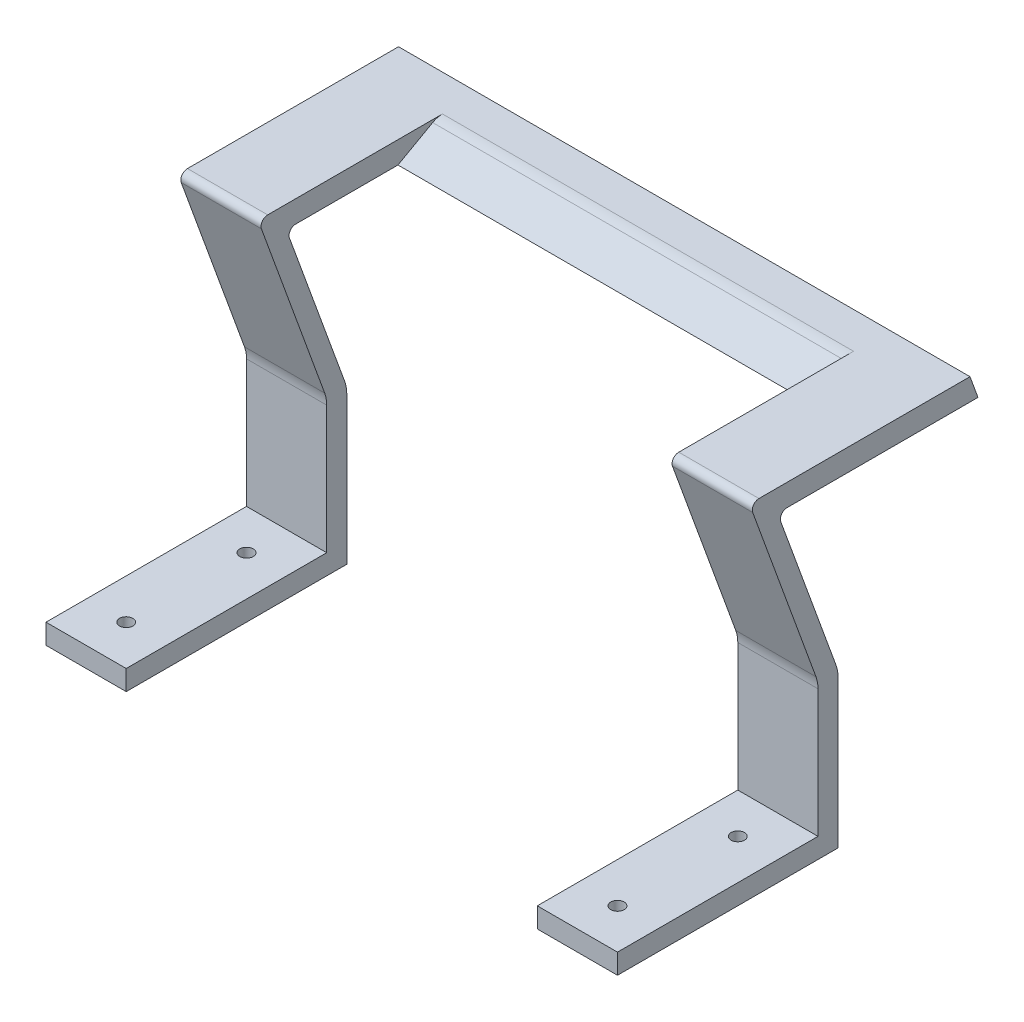
ISO-10303-21;
HEADER;
FILE_DESCRIPTION(('STEP AP214'),'2;1');
FILE_NAME('part.step','',(''),(''),'','','');
FILE_SCHEMA(('AUTOMOTIVE_DESIGN { 1 0 10303 214 1 1 1 1 }'));
ENDSEC;
DATA;
#1=APPLICATION_CONTEXT('core data for automotive mechanical design processes');
#2=APPLICATION_PROTOCOL_DEFINITION('international standard','automotive_design',2000,#1);
#3=PRODUCT_CONTEXT('',#1,'mechanical');
#4=PRODUCT('Part','Part','',(#3));
#5=PRODUCT_RELATED_PRODUCT_CATEGORY('part','',(#4));
#6=PRODUCT_DEFINITION_FORMATION('','',#4);
#7=PRODUCT_DEFINITION_CONTEXT('part definition',#1,'design');
#8=PRODUCT_DEFINITION('design','',#6,#7);
#9=PRODUCT_DEFINITION_SHAPE('','',#8);
#10=(LENGTH_UNIT() NAMED_UNIT(*) SI_UNIT(.MILLI.,.METRE.));
#11=(NAMED_UNIT(*) PLANE_ANGLE_UNIT() SI_UNIT($,.RADIAN.));
#12=(NAMED_UNIT(*) SI_UNIT($,.STERADIAN.) SOLID_ANGLE_UNIT());
#13=UNCERTAINTY_MEASURE_WITH_UNIT(LENGTH_MEASURE(1.E-05),#10,'distance_accuracy_value','');
#14=(GEOMETRIC_REPRESENTATION_CONTEXT(3) GLOBAL_UNCERTAINTY_ASSIGNED_CONTEXT((#13)) GLOBAL_UNIT_ASSIGNED_CONTEXT((#10,
#11,#12)) REPRESENTATION_CONTEXT('',''));
#15=CARTESIAN_POINT('',(0.,0.,0.));
#16=DIRECTION('',(0.,0.,1.));
#17=DIRECTION('',(1.,0.,0.));
#18=AXIS2_PLACEMENT_3D('',#15,#16,#17);
#19=CARTESIAN_POINT('',(12.,3.,-33.));
#20=DIRECTION('',(-1.,0.,0.));
#21=DIRECTION('',(0.,0.,1.));
#22=AXIS2_PLACEMENT_3D('',#19,#20,#21);
#23=PLANE('',#22);
#24=DIRECTION('',(0.,-1.,0.));
#25=VECTOR('',#24,1.);
#26=CARTESIAN_POINT('',(12.,3.,-33.));
#27=LINE('',#26,#25);
#28=CARTESIAN_POINT('',(12.,22.1183650964577,-33.));
#29=VERTEX_POINT('',#28);
#30=CARTESIAN_POINT('',(12.,0.,-33.));
#31=VERTEX_POINT('',#30);
#32=EDGE_CURVE('E451',#29,#31,#27,.T.);
#33=ORIENTED_EDGE('',*,*,#32,.F.);
#34=CARTESIAN_POINT('',(12.,22.1183650964577,-28.));
#35=DIRECTION('',(-1.,0.,0.));
#36=DIRECTION('',(0.,0.,1.));
#37=AXIS2_PLACEMENT_3D('',#34,#35,#36);
#38=CIRCLE('',#37,5.);
#39=CARTESIAN_POINT('',(12.,23.828465813086,-32.6984631039295));
#40=VERTEX_POINT('',#39);
#41=EDGE_CURVE('E507',#29,#40,#38,.F.);
#42=ORIENTED_EDGE('',*,*,#41,.T.);
#43=DIRECTION('',(0.,-0.939692620785905,-0.342020143325678));
#44=VECTOR('',#43,1.);
#45=CARTESIAN_POINT('',(12.,51.1907786235772,-22.7393957002297));
#46=LINE('',#45,#44);
#47=CARTESIAN_POINT('',(12.,46.5598343075008,-24.4249215878258));
#48=VERTEX_POINT('',#47);
#49=EDGE_CURVE('E380',#48,#40,#46,.T.);
#50=ORIENTED_EDGE('',*,*,#49,.F.);
#51=CARTESIAN_POINT('',(12.,46.9018544508265,-25.3646142086117));
#52=DIRECTION('',(-1.,0.,0.));
#53=DIRECTION('',(0.,0.,1.));
#54=AXIS2_PLACEMENT_3D('',#51,#52,#53);
#55=CIRCLE('',#54,1.);
#56=CARTESIAN_POINT('',(12.,47.9018544508265,-25.3646142086117));
#57=VERTEX_POINT('',#56);
#58=EDGE_CURVE('E567',#48,#57,#55,.T.);
#59=ORIENTED_EDGE('',*,*,#58,.T.);
#60=DIRECTION('',(0.,0.,1.));
#61=VECTOR('',#60,1.);
#62=CARTESIAN_POINT('',(12.,47.9018544508265,-53.9364662018696));
#63=LINE('',#62,#61);
#64=CARTESIAN_POINT('',(12.,47.9018544508265,-40.6601602770978));
#65=VERTEX_POINT('',#64);
#66=EDGE_CURVE('E360',#65,#57,#63,.T.);
#67=ORIENTED_EDGE('',*,*,#66,.F.);
#68=DIRECTION('',(0.,-0.488564132575912,0.872527987150181));
#69=VECTOR('',#68,1.);
#70=CARTESIAN_POINT('',(12.,51.1907786235772,-46.5338587273085));
#71=LINE('',#70,#69);
#72=CARTESIAN_POINT('',(12.,50.8083625850277,-45.8509009043299));
#73=VERTEX_POINT('',#72);
#74=EDGE_CURVE('E347',#73,#65,#71,.T.);
#75=ORIENTED_EDGE('',*,*,#74,.F.);
#76=CARTESIAN_POINT('',(12.,48.1907786235772,-47.3165933020576));
#77=DIRECTION('',(-1.,0.,0.));
#78=DIRECTION('',(0.,0.,1.));
#79=AXIS2_PLACEMENT_3D('',#76,#77,#78);
#80=CIRCLE('',#79,3.);
#81=CARTESIAN_POINT('',(12.,51.1907786235772,-47.3165933020576));
#82=VERTEX_POINT('',#81);
#83=EDGE_CURVE('E490',#73,#82,#80,.T.);
#84=ORIENTED_EDGE('',*,*,#83,.T.);
#85=DIRECTION('',(0.,0.,-1.));
#86=VECTOR('',#85,1.);
#87=CARTESIAN_POINT('',(12.,51.1907786235772,-22.7393957002297));
#88=LINE('',#87,#86);
#89=CARTESIAN_POINT('',(12.,51.1907786235772,-21.1675437069718));
#90=VERTEX_POINT('',#89);
#91=EDGE_CURVE('E386',#90,#82,#88,.T.);
#92=ORIENTED_EDGE('',*,*,#91,.F.);
#93=CARTESIAN_POINT('',(12.,50.1907786235772,-21.1675437069718));
#94=DIRECTION('',(-1.,0.,0.));
#95=DIRECTION('',(0.,0.,1.));
#96=AXIS2_PLACEMENT_3D('',#93,#94,#95);
#97=CIRCLE('',#96,1.);
#98=CARTESIAN_POINT('',(12.,49.8487584802515,-20.2278510861859));
#99=VERTEX_POINT('',#98);
#100=EDGE_CURVE('E473',#90,#99,#97,.F.);
#101=ORIENTED_EDGE('',*,*,#100,.T.);
#102=DIRECTION('',(0.,-0.939692620785905,-0.342020143325678));
#103=VECTOR('',#102,1.);
#104=CARTESIAN_POINT('',(12.,51.1907786235772,-19.7393957002297));
#105=LINE('',#104,#103);
#106=CARTESIAN_POINT('',(12.,23.828465813086,-29.6984631039295));
#107=VERTEX_POINT('',#106);
#108=EDGE_CURVE('E376',#99,#107,#105,.T.);
#109=ORIENTED_EDGE('',*,*,#108,.T.);
#110=CARTESIAN_POINT('',(12.,22.1183650964576,-25.));
#111=DIRECTION('',(-1.,0.,0.));
#112=DIRECTION('',(0.,0.,1.));
#113=AXIS2_PLACEMENT_3D('',#110,#111,#112);
#114=CIRCLE('',#113,5.);
#115=CARTESIAN_POINT('',(12.,22.1183650964576,-30.));
#116=VERTEX_POINT('',#115);
#117=EDGE_CURVE('E539',#107,#116,#114,.T.);
#118=ORIENTED_EDGE('',*,*,#117,.T.);
#119=DIRECTION('',(0.,-1.,0.));
#120=VECTOR('',#119,1.);
#121=CARTESIAN_POINT('',(12.,23.,-30.));
#122=LINE('',#121,#120);
#123=CARTESIAN_POINT('',(12.,3.,-30.));
#124=VERTEX_POINT('',#123);
#125=EDGE_CURVE('E396',#116,#124,#122,.T.);
#126=ORIENTED_EDGE('',*,*,#125,.T.);
#127=DIRECTION('',(0.,0.,-1.));
#128=VECTOR('',#127,1.);
#129=CARTESIAN_POINT('',(12.,3.,-33.));
#130=LINE('',#129,#128);
#131=CARTESIAN_POINT('',(12.,3.,0.));
#132=VERTEX_POINT('',#131);
#133=EDGE_CURVE('E423',#132,#124,#130,.T.);
#134=ORIENTED_EDGE('',*,*,#133,.F.);
#135=DIRECTION('',(0.,-1.,0.));
#136=VECTOR('',#135,1.);
#137=CARTESIAN_POINT('',(12.,3.,0.));
#138=LINE('',#137,#136);
#139=CARTESIAN_POINT('',(12.,0.,0.));
#140=VERTEX_POINT('',#139);
#141=EDGE_CURVE('E454',#132,#140,#138,.T.);
#142=ORIENTED_EDGE('',*,*,#141,.T.);
#143=DIRECTION('',(0.,0.,-1.));
#144=VECTOR('',#143,1.);
#145=CARTESIAN_POINT('',(12.,0.,-33.));
#146=LINE('',#145,#144);
#147=EDGE_CURVE('E435',#140,#31,#146,.T.);
#148=ORIENTED_EDGE('',*,*,#147,.T.);
#149=EDGE_LOOP('',(#33,#42,#50,#59,#67,#75,#84,#92,#101,#109,#118,#126,#134,#142,#148));
#150=FACE_BOUND('',#149,.T.);
#151=ADVANCED_FACE('F43',(#150),#23,.F.);
#152=CARTESIAN_POINT('',(0.,51.1907786235772,-22.7393957002297));
#153=DIRECTION('',(0.,-0.342020143325678,0.939692620785905));
#154=DIRECTION('',(0.,-0.939692620785905,-0.342020143325678));
#155=AXIS2_PLACEMENT_3D('',#152,#153,#154);
#156=PLANE('',#155);
#157=DIRECTION('',(0.,-0.939692620785905,-0.342020143325678));
#158=VECTOR('',#157,1.);
#159=CARTESIAN_POINT('',(0.,51.1907786235772,-22.7393957002297));
#160=LINE('',#159,#158);
#161=CARTESIAN_POINT('',(0.,46.5598343075008,-24.4249215878258));
#162=VERTEX_POINT('',#161);
#163=CARTESIAN_POINT('',(0.,23.828465813086,-32.6984631039295));
#164=VERTEX_POINT('',#163);
#165=EDGE_CURVE('E383',#162,#164,#160,.T.);
#166=ORIENTED_EDGE('',*,*,#165,.F.);
#167=DIRECTION('',(-1.,0.,0.));
#168=VECTOR('',#167,1.);
#169=CARTESIAN_POINT('',(12.,46.5598343075008,-24.4249215878258));
#170=LINE('',#169,#168);
#171=EDGE_CURVE('E559',#162,#48,#170,.F.);
#172=ORIENTED_EDGE('',*,*,#171,.T.);
#173=ORIENTED_EDGE('',*,*,#49,.T.);
#174=DIRECTION('',(-1.,0.,0.));
#175=VECTOR('',#174,1.);
#176=CARTESIAN_POINT('',(0.,23.828465813086,-32.6984631039295));
#177=LINE('',#176,#175);
#178=EDGE_CURVE('E497',#40,#164,#177,.T.);
#179=ORIENTED_EDGE('',*,*,#178,.T.);
#180=EDGE_LOOP('',(#166,#172,#173,#179));
#181=FACE_BOUND('',#180,.T.);
#182=ADVANCED_FACE('F590',(#181),#156,.F.);
#183=CARTESIAN_POINT('',(0.,3.,0.));
#184=DIRECTION('',(0.,-1.,0.));
#185=DIRECTION('',(0.,0.,-1.));
#186=AXIS2_PLACEMENT_3D('',#183,#184,#185);
#187=PLANE('',#186);
#188=CARTESIAN_POINT('',(6.,3.,-6.));
#189=DIRECTION('',(0.,1.,0.));
#190=DIRECTION('',(0.,0.,1.));
#191=AXIS2_PLACEMENT_3D('',#188,#189,#190);
#192=CIRCLE('',#191,1.);
#193=CARTESIAN_POINT('',(6.,3.,-5.));
#194=VERTEX_POINT('',#193);
#195=EDGE_CURVE('E403',#194,#194,#192,.T.);
#196=ORIENTED_EDGE('',*,*,#195,.F.);
#197=EDGE_LOOP('',(#196));
#198=FACE_BOUND('',#197,.T.);
#199=CARTESIAN_POINT('',(6.,3.,-24.));
#200=DIRECTION('',(0.,1.,0.));
#201=DIRECTION('',(0.,0.,1.));
#202=AXIS2_PLACEMENT_3D('',#199,#200,#201);
#203=CIRCLE('',#202,1.);
#204=CARTESIAN_POINT('',(6.,3.,-23.));
#205=VERTEX_POINT('',#204);
#206=EDGE_CURVE('E411',#205,#205,#203,.T.);
#207=ORIENTED_EDGE('',*,*,#206,.F.);
#208=EDGE_LOOP('',(#207));
#209=FACE_BOUND('',#208,.T.);
#210=DIRECTION('',(1.,0.,0.));
#211=VECTOR('',#210,1.);
#212=CARTESIAN_POINT('',(0.,3.,-30.));
#213=LINE('',#212,#211);
#214=CARTESIAN_POINT('',(0.,3.,-30.));
#215=VERTEX_POINT('',#214);
#216=EDGE_CURVE('E392',#215,#124,#213,.T.);
#217=ORIENTED_EDGE('',*,*,#216,.F.);
#218=DIRECTION('',(0.,0.,1.));
#219=VECTOR('',#218,1.);
#220=CARTESIAN_POINT('',(0.,3.,0.));
#221=LINE('',#220,#219);
#222=CARTESIAN_POINT('',(0.,3.,0.));
#223=VERTEX_POINT('',#222);
#224=EDGE_CURVE('E428',#215,#223,#221,.T.);
#225=ORIENTED_EDGE('',*,*,#224,.T.);
#226=DIRECTION('',(1.,0.,0.));
#227=VECTOR('',#226,1.);
#228=CARTESIAN_POINT('',(12.,3.,0.));
#229=LINE('',#228,#227);
#230=EDGE_CURVE('E419',#223,#132,#229,.T.);
#231=ORIENTED_EDGE('',*,*,#230,.T.);
#232=ORIENTED_EDGE('',*,*,#133,.T.);
#233=EDGE_LOOP('',(#217,#225,#231,#232));
#234=FACE_BOUND('',#233,.T.);
#235=ADVANCED_FACE('F613',(#198,#209,#234),#187,.F.);
#236=CARTESIAN_POINT('',(0.,0.,0.));
#237=DIRECTION('',(0.,-1.,0.));
#238=DIRECTION('',(0.,0.,-1.));
#239=AXIS2_PLACEMENT_3D('',#236,#237,#238);
#240=PLANE('',#239);
#241=CARTESIAN_POINT('',(6.,0.,-24.));
#242=DIRECTION('',(0.,1.,0.));
#243=DIRECTION('',(0.,0.,1.));
#244=AXIS2_PLACEMENT_3D('',#241,#242,#243);
#245=CIRCLE('',#244,1.);
#246=CARTESIAN_POINT('',(6.,0.,-23.));
#247=VERTEX_POINT('',#246);
#248=EDGE_CURVE('E407',#247,#247,#245,.T.);
#249=ORIENTED_EDGE('',*,*,#248,.T.);
#250=EDGE_LOOP('',(#249));
#251=FACE_BOUND('',#250,.T.);
#252=DIRECTION('',(1.,0.,0.));
#253=VECTOR('',#252,1.);
#254=CARTESIAN_POINT('',(12.,0.,0.));
#255=LINE('',#254,#253);
#256=CARTESIAN_POINT('',(0.,0.,0.));
#257=VERTEX_POINT('',#256);
#258=EDGE_CURVE('E415',#257,#140,#255,.T.);
#259=ORIENTED_EDGE('',*,*,#258,.F.);
#260=DIRECTION('',(0.,0.,1.));
#261=VECTOR('',#260,1.);
#262=CARTESIAN_POINT('',(0.,0.,0.));
#263=LINE('',#262,#261);
#264=CARTESIAN_POINT('',(0.,0.,-33.));
#265=VERTEX_POINT('',#264);
#266=EDGE_CURVE('E424',#265,#257,#263,.T.);
#267=ORIENTED_EDGE('',*,*,#266,.F.);
#268=DIRECTION('',(-1.,0.,0.));
#269=VECTOR('',#268,1.);
#270=CARTESIAN_POINT('',(0.,0.,-33.));
#271=LINE('',#270,#269);
#272=EDGE_CURVE('E439',#31,#265,#271,.T.);
#273=ORIENTED_EDGE('',*,*,#272,.F.);
#274=ORIENTED_EDGE('',*,*,#147,.F.);
#275=EDGE_LOOP('',(#259,#267,#273,#274));
#276=FACE_BOUND('',#275,.T.);
#277=CARTESIAN_POINT('',(6.,0.,-6.));
#278=DIRECTION('',(0.,1.,0.));
#279=DIRECTION('',(0.,0.,1.));
#280=AXIS2_PLACEMENT_3D('',#277,#278,#279);
#281=CIRCLE('',#280,1.);
#282=CARTESIAN_POINT('',(6.,0.,-5.));
#283=VERTEX_POINT('',#282);
#284=EDGE_CURVE('E402',#283,#283,#281,.T.);
#285=ORIENTED_EDGE('',*,*,#284,.T.);
#286=EDGE_LOOP('',(#285));
#287=FACE_BOUND('',#286,.T.);
#288=ADVANCED_FACE('F603',(#251,#276,#287),#240,.T.);
#289=CARTESIAN_POINT('',(12.,3.,0.));
#290=DIRECTION('',(0.,0.,-1.));
#291=DIRECTION('',(-1.,0.,0.));
#292=AXIS2_PLACEMENT_3D('',#289,#290,#291);
#293=PLANE('',#292);
#294=ORIENTED_EDGE('',*,*,#258,.T.);
#295=ORIENTED_EDGE('',*,*,#141,.F.);
#296=ORIENTED_EDGE('',*,*,#230,.F.);
#297=DIRECTION('',(0.,-1.,0.));
#298=VECTOR('',#297,1.);
#299=CARTESIAN_POINT('',(0.,3.,0.));
#300=LINE('',#299,#298);
#301=EDGE_CURVE('E431',#223,#257,#300,.T.);
#302=ORIENTED_EDGE('',*,*,#301,.T.);
#303=EDGE_LOOP('',(#294,#295,#296,#302));
#304=FACE_BOUND('',#303,.T.);
#305=ADVANCED_FACE('F609',(#304),#293,.F.);
#306=CARTESIAN_POINT('',(0.,3.,-33.));
#307=DIRECTION('',(0.,0.,1.));
#308=DIRECTION('',(1.,0.,0.));
#309=AXIS2_PLACEMENT_3D('',#306,#307,#308);
#310=PLANE('',#309);
#311=DIRECTION('',(0.,-1.,0.));
#312=VECTOR('',#311,1.);
#313=CARTESIAN_POINT('',(0.,3.,-33.));
#314=LINE('',#313,#312);
#315=CARTESIAN_POINT('',(0.,22.1183650964577,-33.));
#316=VERTEX_POINT('',#315);
#317=EDGE_CURVE('E448',#316,#265,#314,.T.);
#318=ORIENTED_EDGE('',*,*,#317,.F.);
#319=DIRECTION('',(-1.,0.,0.));
#320=VECTOR('',#319,1.);
#321=CARTESIAN_POINT('',(0.,22.1183650964577,-33.));
#322=LINE('',#321,#320);
#323=EDGE_CURVE('E504',#316,#29,#322,.F.);
#324=ORIENTED_EDGE('',*,*,#323,.T.);
#325=ORIENTED_EDGE('',*,*,#32,.T.);
#326=ORIENTED_EDGE('',*,*,#272,.T.);
#327=EDGE_LOOP('',(#318,#324,#325,#326));
#328=FACE_BOUND('',#327,.T.);
#329=ADVANCED_FACE('F598',(#328),#310,.F.);
#330=CARTESIAN_POINT('',(0.,3.,0.));
#331=DIRECTION('',(1.,0.,0.));
#332=DIRECTION('',(0.,0.,-1.));
#333=AXIS2_PLACEMENT_3D('',#330,#331,#332);
#334=PLANE('',#333);
#335=DIRECTION('',(0.,0.,1.));
#336=VECTOR('',#335,1.);
#337=CARTESIAN_POINT('',(0.,47.9018544508265,-53.9364662018696));
#338=LINE('',#337,#336);
#339=CARTESIAN_POINT('',(0.,47.9018544508265,-53.9364662018696));
#340=VERTEX_POINT('',#339);
#341=CARTESIAN_POINT('',(0.,47.9018544508265,-25.3646142086117));
#342=VERTEX_POINT('',#341);
#343=EDGE_CURVE('E257',#340,#342,#338,.T.);
#344=ORIENTED_EDGE('',*,*,#343,.T.);
#345=CARTESIAN_POINT('',(0.,46.9018544508265,-25.3646142086117));
#346=DIRECTION('',(1.,0.,0.));
#347=DIRECTION('',(0.,0.,-1.));
#348=AXIS2_PLACEMENT_3D('',#345,#346,#347);
#349=CIRCLE('',#348,1.);
#350=EDGE_CURVE('E564',#342,#162,#349,.T.);
#351=ORIENTED_EDGE('',*,*,#350,.T.);
#352=ORIENTED_EDGE('',*,*,#165,.T.);
#353=CARTESIAN_POINT('',(0.,22.1183650964577,-28.));
#354=DIRECTION('',(1.,0.,0.));
#355=DIRECTION('',(0.,0.,-1.));
#356=AXIS2_PLACEMENT_3D('',#353,#354,#355);
#357=CIRCLE('',#356,5.);
#358=EDGE_CURVE('E501',#164,#316,#357,.F.);
#359=ORIENTED_EDGE('',*,*,#358,.T.);
#360=ORIENTED_EDGE('',*,*,#317,.T.);
#361=ORIENTED_EDGE('',*,*,#266,.T.);
#362=ORIENTED_EDGE('',*,*,#301,.F.);
#363=ORIENTED_EDGE('',*,*,#224,.F.);
#364=DIRECTION('',(0.,-1.,0.));
#365=VECTOR('',#364,1.);
#366=CARTESIAN_POINT('',(0.,23.,-30.));
#367=LINE('',#366,#365);
#368=CARTESIAN_POINT('',(0.,22.1183650964576,-30.));
#369=VERTEX_POINT('',#368);
#370=EDGE_CURVE('E399',#369,#215,#367,.T.);
#371=ORIENTED_EDGE('',*,*,#370,.F.);
#372=CARTESIAN_POINT('',(0.,22.1183650964576,-25.));
#373=DIRECTION('',(1.,0.,0.));
#374=DIRECTION('',(0.,0.,-1.));
#375=AXIS2_PLACEMENT_3D('',#372,#373,#374);
#376=CIRCLE('',#375,5.);
#377=CARTESIAN_POINT('',(0.,23.828465813086,-29.6984631039295));
#378=VERTEX_POINT('',#377);
#379=EDGE_CURVE('E542',#369,#378,#376,.T.);
#380=ORIENTED_EDGE('',*,*,#379,.T.);
#381=DIRECTION('',(0.,-0.939692620785905,-0.342020143325678));
#382=VECTOR('',#381,1.);
#383=CARTESIAN_POINT('',(0.,51.1907786235772,-19.7393957002297));
#384=LINE('',#383,#382);
#385=CARTESIAN_POINT('',(0.,49.8487584802515,-20.2278510861859));
#386=VERTEX_POINT('',#385);
#387=EDGE_CURVE('E372',#386,#378,#384,.T.);
#388=ORIENTED_EDGE('',*,*,#387,.F.);
#389=CARTESIAN_POINT('',(0.,50.1907786235772,-21.1675437069718));
#390=DIRECTION('',(1.,0.,0.));
#391=DIRECTION('',(0.,0.,-1.));
#392=AXIS2_PLACEMENT_3D('',#389,#390,#391);
#393=CIRCLE('',#392,1.);
#394=CARTESIAN_POINT('',(0.,51.1907786235772,-21.1675437069718));
#395=VERTEX_POINT('',#394);
#396=EDGE_CURVE('E479',#386,#395,#393,.F.);
#397=ORIENTED_EDGE('',*,*,#396,.T.);
#398=DIRECTION('',(0.,0.,1.));
#399=VECTOR('',#398,1.);
#400=CARTESIAN_POINT('',(0.,51.1907786235772,-19.7393957002297));
#401=LINE('',#400,#399);
#402=CARTESIAN_POINT('',(0.,51.1907786235772,-52.7393957002297));
#403=VERTEX_POINT('',#402);
#404=EDGE_CURVE('E389',#403,#395,#401,.T.);
#405=ORIENTED_EDGE('',*,*,#404,.F.);
#406=DIRECTION('',(0.,0.939692620785905,0.342020143325678));
#407=VECTOR('',#406,1.);
#408=CARTESIAN_POINT('',(0.,51.1907786235772,-52.7393957002297));
#409=LINE('',#408,#407);
#410=EDGE_CURVE('E255',#340,#403,#409,.T.);
#411=ORIENTED_EDGE('',*,*,#410,.F.);
#412=EDGE_LOOP('',(#344,#351,#352,#359,#360,#361,#362,#363,#371,#380,#388,#397,#405,#411));
#413=FACE_BOUND('',#412,.T.);
#414=ADVANCED_FACE('F587',(#413),#334,.F.);
#415=CARTESIAN_POINT('',(6.,3.,-24.));
#416=DIRECTION('',(0.,-1.,0.));
#417=DIRECTION('',(0.,0.,-1.));
#418=AXIS2_PLACEMENT_3D('',#415,#416,#417);
#419=CYLINDRICAL_SURFACE('',#418,1.);
#420=ORIENTED_EDGE('',*,*,#206,.T.);
#421=EDGE_LOOP('',(#420));
#422=FACE_BOUND('',#421,.T.);
#423=ORIENTED_EDGE('',*,*,#248,.F.);
#424=EDGE_LOOP('',(#423));
#425=FACE_BOUND('',#424,.T.);
#426=ADVANCED_FACE('F720',(#422,#425),#419,.F.);
#427=CARTESIAN_POINT('',(6.,3.,-6.));
#428=DIRECTION('',(0.,-1.,0.));
#429=DIRECTION('',(0.,0.,-1.));
#430=AXIS2_PLACEMENT_3D('',#427,#428,#429);
#431=CYLINDRICAL_SURFACE('',#430,1.);
#432=ORIENTED_EDGE('',*,*,#195,.T.);
#433=EDGE_LOOP('',(#432));
#434=FACE_BOUND('',#433,.T.);
#435=ORIENTED_EDGE('',*,*,#284,.F.);
#436=EDGE_LOOP('',(#435));
#437=FACE_BOUND('',#436,.T.);
#438=ADVANCED_FACE('F724',(#434,#437),#431,.F.);
#439=CARTESIAN_POINT('',(0.,23.,-30.));
#440=DIRECTION('',(0.,0.,-1.));
#441=DIRECTION('',(-1.,0.,0.));
#442=AXIS2_PLACEMENT_3D('',#439,#440,#441);
#443=PLANE('',#442);
#444=ORIENTED_EDGE('',*,*,#125,.F.);
#445=DIRECTION('',(1.,0.,0.));
#446=VECTOR('',#445,1.);
#447=CARTESIAN_POINT('',(0.,22.1183650964576,-30.));
#448=LINE('',#447,#446);
#449=EDGE_CURVE('E529',#116,#369,#448,.F.);
#450=ORIENTED_EDGE('',*,*,#449,.T.);
#451=ORIENTED_EDGE('',*,*,#370,.T.);
#452=ORIENTED_EDGE('',*,*,#216,.T.);
#453=EDGE_LOOP('',(#444,#450,#451,#452));
#454=FACE_BOUND('',#453,.T.);
#455=ADVANCED_FACE('F729',(#454),#443,.F.);
#456=CARTESIAN_POINT('',(12.,51.1907786235772,-19.7393957002297));
#457=DIRECTION('',(0.,0.342020143325678,-0.939692620785905));
#458=DIRECTION('',(0.,0.939692620785905,0.342020143325678));
#459=AXIS2_PLACEMENT_3D('',#456,#457,#458);
#460=PLANE('',#459);
#461=ORIENTED_EDGE('',*,*,#387,.T.);
#462=DIRECTION('',(1.,0.,0.));
#463=VECTOR('',#462,1.);
#464=CARTESIAN_POINT('',(12.,23.828465813086,-29.6984631039295));
#465=LINE('',#464,#463);
#466=EDGE_CURVE('E525',#378,#107,#465,.T.);
#467=ORIENTED_EDGE('',*,*,#466,.T.);
#468=ORIENTED_EDGE('',*,*,#108,.F.);
#469=DIRECTION('',(1.,0.,0.));
#470=VECTOR('',#469,1.);
#471=CARTESIAN_POINT('',(12.,49.8487584802515,-20.2278510861859));
#472=LINE('',#471,#470);
#473=EDGE_CURVE('E476',#99,#386,#472,.F.);
#474=ORIENTED_EDGE('',*,*,#473,.T.);
#475=EDGE_LOOP('',(#461,#467,#468,#474));
#476=FACE_BOUND('',#475,.T.);
#477=ADVANCED_FACE('F624',(#476),#460,.F.);
#478=CARTESIAN_POINT('',(0.,51.1907786235772,10.2606042997703));
#479=DIRECTION('',(0.,-1.,0.));
#480=DIRECTION('',(0.,0.,-1.));
#481=AXIS2_PLACEMENT_3D('',#478,#479,#480);
#482=PLANE('',#481);
#483=ORIENTED_EDGE('',*,*,#91,.T.);
#484=DIRECTION('',(-1.,0.,0.));
#485=VECTOR('',#484,1.);
#486=CARTESIAN_POINT('',(0.,51.1907786235772,-47.3165933020576));
#487=LINE('',#486,#485);
#488=CARTESIAN_POINT('',(73.5,51.1907786235772,-47.3165933020576));
#489=VERTEX_POINT('',#488);
#490=EDGE_CURVE('E486',#82,#489,#487,.F.);
#491=ORIENTED_EDGE('',*,*,#490,.T.);
#492=DIRECTION('',(0.,0.,1.));
#493=VECTOR('',#492,1.);
#494=CARTESIAN_POINT('',(73.5,51.1907786235772,-22.7393957002297));
#495=LINE('',#494,#493);
#496=CARTESIAN_POINT('',(73.5,51.1907786235772,-21.1675437069718));
#497=VERTEX_POINT('',#496);
#498=EDGE_CURVE('E246',#489,#497,#495,.T.);
#499=ORIENTED_EDGE('',*,*,#498,.T.);
#500=DIRECTION('',(1.,0.,0.));
#501=VECTOR('',#500,1.);
#502=CARTESIAN_POINT('',(0.,51.1907786235772,-21.1675437069718));
#503=LINE('',#502,#501);
#504=CARTESIAN_POINT('',(85.5,51.1907786235772,-21.1675437069718));
#505=VERTEX_POINT('',#504);
#506=EDGE_CURVE('E241',#497,#505,#503,.T.);
#507=ORIENTED_EDGE('',*,*,#506,.T.);
#508=DIRECTION('',(0.,0.,-1.));
#509=VECTOR('',#508,1.);
#510=CARTESIAN_POINT('',(85.5,51.1907786235772,-19.7393957002297));
#511=LINE('',#510,#509);
#512=CARTESIAN_POINT('',(85.5,51.1907786235772,-52.7393957002297));
#513=VERTEX_POINT('',#512);
#514=EDGE_CURVE('E234',#505,#513,#511,.T.);
#515=ORIENTED_EDGE('',*,*,#514,.T.);
#516=DIRECTION('',(1.,0.,0.));
#517=VECTOR('',#516,1.);
#518=CARTESIAN_POINT('',(12.,51.1907786235772,-52.7393957002297));
#519=LINE('',#518,#517);
#520=EDGE_CURVE('E238',#403,#513,#519,.T.);
#521=ORIENTED_EDGE('',*,*,#520,.F.);
#522=ORIENTED_EDGE('',*,*,#404,.T.);
#523=DIRECTION('',(1.,0.,0.));
#524=VECTOR('',#523,1.);
#525=CARTESIAN_POINT('',(0.,51.1907786235772,-21.1675437069718));
#526=LINE('',#525,#524);
#527=EDGE_CURVE('E458',#395,#90,#526,.T.);
#528=ORIENTED_EDGE('',*,*,#527,.T.);
#529=EDGE_LOOP('',(#483,#491,#499,#507,#515,#521,#522,#528));
#530=FACE_BOUND('',#529,.T.);
#531=ADVANCED_FACE('F236',(#530),#482,.F.);
#532=CARTESIAN_POINT('',(0.,47.9018544508265,-53.9364662018696));
#533=DIRECTION('',(0.,1.,0.));
#534=DIRECTION('',(0.,0.,1.));
#535=AXIS2_PLACEMENT_3D('',#532,#533,#534);
#536=PLANE('',#535);
#537=ORIENTED_EDGE('',*,*,#66,.T.);
#538=DIRECTION('',(-1.,0.,0.));
#539=VECTOR('',#538,1.);
#540=CARTESIAN_POINT('',(0.,47.9018544508265,-25.3646142086117));
#541=LINE('',#540,#539);
#542=EDGE_CURVE('E555',#57,#342,#541,.T.);
#543=ORIENTED_EDGE('',*,*,#542,.T.);
#544=ORIENTED_EDGE('',*,*,#343,.F.);
#545=DIRECTION('',(-1.,0.,0.));
#546=VECTOR('',#545,1.);
#547=CARTESIAN_POINT('',(0.,47.9018544508265,-53.9364662018696));
#548=LINE('',#547,#546);
#549=CARTESIAN_POINT('',(85.5,47.9018544508265,-53.9364662018696));
#550=VERTEX_POINT('',#549);
#551=EDGE_CURVE('E369',#550,#340,#548,.T.);
#552=ORIENTED_EDGE('',*,*,#551,.F.);
#553=DIRECTION('',(0.,0.,1.));
#554=VECTOR('',#553,1.);
#555=CARTESIAN_POINT('',(85.5,47.9018544508265,-53.9364662018696));
#556=LINE('',#555,#554);
#557=CARTESIAN_POINT('',(85.5,47.9018544508265,-25.3646142086117));
#558=VERTEX_POINT('',#557);
#559=EDGE_CURVE('E262',#550,#558,#556,.T.);
#560=ORIENTED_EDGE('',*,*,#559,.T.);
#561=DIRECTION('',(-1.,0.,0.));
#562=VECTOR('',#561,1.);
#563=CARTESIAN_POINT('',(73.5,47.9018544508265,-25.3646142086117));
#564=LINE('',#563,#562);
#565=CARTESIAN_POINT('',(73.5,47.9018544508265,-25.3646142086117));
#566=VERTEX_POINT('',#565);
#567=EDGE_CURVE('E551',#558,#566,#564,.T.);
#568=ORIENTED_EDGE('',*,*,#567,.T.);
#569=DIRECTION('',(0.,0.,1.));
#570=VECTOR('',#569,1.);
#571=CARTESIAN_POINT('',(73.5,47.9018544508265,-53.9364662018696));
#572=LINE('',#571,#570);
#573=CARTESIAN_POINT('',(73.5,47.9018544508265,-40.6601602770978));
#574=VERTEX_POINT('',#573);
#575=EDGE_CURVE('E264',#574,#566,#572,.T.);
#576=ORIENTED_EDGE('',*,*,#575,.F.);
#577=DIRECTION('',(-1.,0.,0.));
#578=VECTOR('',#577,1.);
#579=CARTESIAN_POINT('',(73.5,47.9018544508265,-40.6601602770978));
#580=LINE('',#579,#578);
#581=EDGE_CURVE('E354',#574,#65,#580,.T.);
#582=ORIENTED_EDGE('',*,*,#581,.T.);
#583=EDGE_LOOP('',(#537,#543,#544,#552,#560,#568,#576,#582));
#584=FACE_BOUND('',#583,.T.);
#585=ADVANCED_FACE('F580',(#584),#536,.F.);
#586=CARTESIAN_POINT('',(0.,13.2964844639601,-66.5317908228583));
#587=DIRECTION('',(0.,-0.342020143325678,0.939692620785905));
#588=DIRECTION('',(0.,-0.939692620785905,-0.342020143325678));
#589=AXIS2_PLACEMENT_3D('',#586,#587,#588);
#590=PLANE('',#589);
#591=ORIENTED_EDGE('',*,*,#520,.T.);
#592=DIRECTION('',(0.,-0.939692620785905,-0.342020143325678));
#593=VECTOR('',#592,1.);
#594=CARTESIAN_POINT('',(85.5,51.1907786235772,-52.7393957002297));
#595=LINE('',#594,#593);
#596=EDGE_CURVE('E252',#513,#550,#595,.T.);
#597=ORIENTED_EDGE('',*,*,#596,.T.);
#598=ORIENTED_EDGE('',*,*,#551,.T.);
#599=ORIENTED_EDGE('',*,*,#410,.T.);
#600=EDGE_LOOP('',(#591,#597,#598,#599));
#601=FACE_BOUND('',#600,.T.);
#602=ADVANCED_FACE('F251',(#601),#590,.F.);
#603=CARTESIAN_POINT('',(73.5,51.1907786235772,-46.5338587273086));
#604=DIRECTION('',(0.,-0.872527987150181,-0.488564132575912));
#605=DIRECTION('',(0.,0.488564132575912,-0.872527987150181));
#606=AXIS2_PLACEMENT_3D('',#603,#604,#605);
#607=PLANE('',#606);
#608=DIRECTION('',(0.,-0.488564132575912,0.872527987150181));
#609=VECTOR('',#608,1.);
#610=CARTESIAN_POINT('',(73.5,51.1907786235772,-46.5338587273086));
#611=LINE('',#610,#609);
#612=CARTESIAN_POINT('',(73.5,50.8083625850277,-45.8509009043299));
#613=VERTEX_POINT('',#612);
#614=EDGE_CURVE('E351',#613,#574,#611,.T.);
#615=ORIENTED_EDGE('',*,*,#614,.F.);
#616=DIRECTION('',(-1.,0.,0.));
#617=VECTOR('',#616,1.);
#618=CARTESIAN_POINT('',(73.5,50.8083625850277,-45.8509009043299));
#619=LINE('',#618,#617);
#620=EDGE_CURVE('E482',#613,#73,#619,.T.);
#621=ORIENTED_EDGE('',*,*,#620,.T.);
#622=ORIENTED_EDGE('',*,*,#74,.T.);
#623=ORIENTED_EDGE('',*,*,#581,.F.);
#624=EDGE_LOOP('',(#615,#621,#622,#623));
#625=FACE_BOUND('',#624,.T.);
#626=ADVANCED_FACE('F640',(#625),#607,.F.);
#627=CARTESIAN_POINT('',(73.5,3.,-33.));
#628=DIRECTION('',(1.,0.,0.));
#629=DIRECTION('',(0.,0.,-1.));
#630=AXIS2_PLACEMENT_3D('',#627,#628,#629);
#631=PLANE('',#630);
#632=ORIENTED_EDGE('',*,*,#575,.T.);
#633=CARTESIAN_POINT('',(73.5,46.9018544508265,-25.3646142086117));
#634=DIRECTION('',(1.,0.,0.));
#635=DIRECTION('',(0.,0.,-1.));
#636=AXIS2_PLACEMENT_3D('',#633,#634,#635);
#637=CIRCLE('',#636,1.);
#638=CARTESIAN_POINT('',(73.5,46.5598343075008,-24.4249215878258));
#639=VERTEX_POINT('',#638);
#640=EDGE_CURVE('E52',#566,#639,#637,.T.);
#641=ORIENTED_EDGE('',*,*,#640,.T.);
#642=DIRECTION('',(0.,-0.939692620785905,-0.342020143325678));
#643=VECTOR('',#642,1.);
#644=CARTESIAN_POINT('',(73.5,51.1907786235772,-22.7393957002297));
#645=LINE('',#644,#643);
#646=CARTESIAN_POINT('',(73.5,23.828465813086,-32.6984631039295));
#647=VERTEX_POINT('',#646);
#648=EDGE_CURVE('E283',#639,#647,#645,.T.);
#649=ORIENTED_EDGE('',*,*,#648,.T.);
#650=CARTESIAN_POINT('',(73.5,22.1183650964577,-28.));
#651=DIRECTION('',(1.,0.,0.));
#652=DIRECTION('',(0.,0.,-1.));
#653=AXIS2_PLACEMENT_3D('',#650,#651,#652);
#654=CIRCLE('',#653,5.);
#655=CARTESIAN_POINT('',(73.5,22.1183650964577,-33.));
#656=VERTEX_POINT('',#655);
#657=EDGE_CURVE('E515',#647,#656,#654,.F.);
#658=ORIENTED_EDGE('',*,*,#657,.T.);
#659=DIRECTION('',(0.,-1.,0.));
#660=VECTOR('',#659,1.);
#661=CARTESIAN_POINT('',(73.5,3.,-33.));
#662=LINE('',#661,#660);
#663=CARTESIAN_POINT('',(73.5,0.,-33.));
#664=VERTEX_POINT('',#663);
#665=EDGE_CURVE('E296',#656,#664,#662,.T.);
#666=ORIENTED_EDGE('',*,*,#665,.T.);
#667=DIRECTION('',(0.,0.,1.));
#668=VECTOR('',#667,1.);
#669=CARTESIAN_POINT('',(73.5,0.,-33.));
#670=LINE('',#669,#668);
#671=CARTESIAN_POINT('',(73.5,0.,0.));
#672=VERTEX_POINT('',#671);
#673=EDGE_CURVE('E319',#664,#672,#670,.T.);
#674=ORIENTED_EDGE('',*,*,#673,.T.);
#675=DIRECTION('',(0.,-1.,0.));
#676=VECTOR('',#675,1.);
#677=CARTESIAN_POINT('',(73.5,3.,0.));
#678=LINE('',#677,#676);
#679=CARTESIAN_POINT('',(73.5,3.,0.));
#680=VERTEX_POINT('',#679);
#681=EDGE_CURVE('E299',#680,#672,#678,.T.);
#682=ORIENTED_EDGE('',*,*,#681,.F.);
#683=DIRECTION('',(0.,0.,1.));
#684=VECTOR('',#683,1.);
#685=CARTESIAN_POINT('',(73.5,3.,-33.));
#686=LINE('',#685,#684);
#687=CARTESIAN_POINT('',(73.5,3.,-30.));
#688=VERTEX_POINT('',#687);
#689=EDGE_CURVE('E316',#688,#680,#686,.T.);
#690=ORIENTED_EDGE('',*,*,#689,.F.);
#691=DIRECTION('',(0.,-1.,0.));
#692=VECTOR('',#691,1.);
#693=CARTESIAN_POINT('',(73.5,23.,-30.));
#694=LINE('',#693,#692);
#695=CARTESIAN_POINT('',(73.5,22.1183650964576,-30.));
#696=VERTEX_POINT('',#695);
#697=EDGE_CURVE('E286',#696,#688,#694,.T.);
#698=ORIENTED_EDGE('',*,*,#697,.F.);
#699=CARTESIAN_POINT('',(73.5,22.1183650964576,-25.));
#700=DIRECTION('',(1.,0.,0.));
#701=DIRECTION('',(0.,0.,-1.));
#702=AXIS2_PLACEMENT_3D('',#699,#700,#701);
#703=CIRCLE('',#702,5.);
#704=CARTESIAN_POINT('',(73.5,23.828465813086,-29.6984631039295));
#705=VERTEX_POINT('',#704);
#706=EDGE_CURVE('E548',#696,#705,#703,.T.);
#707=ORIENTED_EDGE('',*,*,#706,.T.);
#708=DIRECTION('',(0.,-0.939692620785905,-0.342020143325678));
#709=VECTOR('',#708,1.);
#710=CARTESIAN_POINT('',(73.5,51.1907786235772,-19.7393957002297));
#711=LINE('',#710,#709);
#712=CARTESIAN_POINT('',(73.5,49.8487584802515,-20.2278510861859));
#713=VERTEX_POINT('',#712);
#714=EDGE_CURVE('E279',#713,#705,#711,.T.);
#715=ORIENTED_EDGE('',*,*,#714,.F.);
#716=CARTESIAN_POINT('',(73.5,50.1907786235772,-21.1675437069718));
#717=DIRECTION('',(1.,0.,0.));
#718=DIRECTION('',(0.,0.,-1.));
#719=AXIS2_PLACEMENT_3D('',#716,#717,#718);
#720=CIRCLE('',#719,1.);
#721=EDGE_CURVE('E470',#713,#497,#720,.F.);
#722=ORIENTED_EDGE('',*,*,#721,.T.);
#723=ORIENTED_EDGE('',*,*,#498,.F.);
#724=CARTESIAN_POINT('',(73.5,48.1907786235772,-47.3165933020576));
#725=DIRECTION('',(1.,0.,0.));
#726=DIRECTION('',(0.,0.,-1.));
#727=AXIS2_PLACEMENT_3D('',#724,#725,#726);
#728=CIRCLE('',#727,3.);
#729=EDGE_CURVE('E494',#489,#613,#728,.T.);
#730=ORIENTED_EDGE('',*,*,#729,.T.);
#731=ORIENTED_EDGE('',*,*,#614,.T.);
#732=EDGE_LOOP('',(#632,#641,#649,#658,#666,#674,#682,#690,#698,#707,#715,#722,#723,#730,#731));
#733=FACE_BOUND('',#732,.T.);
#734=ADVANCED_FACE('F638',(#733),#631,.F.);
#735=CARTESIAN_POINT('',(85.5,51.1907786235772,-22.7393957002297));
#736=DIRECTION('',(0.,-0.342020143325678,0.939692620785905));
#737=DIRECTION('',(0.,-0.939692620785905,-0.342020143325678));
#738=AXIS2_PLACEMENT_3D('',#735,#736,#737);
#739=PLANE('',#738);
#740=ORIENTED_EDGE('',*,*,#648,.F.);
#741=DIRECTION('',(-1.,0.,0.));
#742=VECTOR('',#741,1.);
#743=CARTESIAN_POINT('',(85.5,46.5598343075008,-24.4249215878258));
#744=LINE('',#743,#742);
#745=CARTESIAN_POINT('',(85.5,46.5598343075008,-24.4249215878258));
#746=VERTEX_POINT('',#745);
#747=EDGE_CURVE('E65',#639,#746,#744,.F.);
#748=ORIENTED_EDGE('',*,*,#747,.T.);
#749=DIRECTION('',(0.,-0.939692620785905,-0.342020143325678));
#750=VECTOR('',#749,1.);
#751=CARTESIAN_POINT('',(85.5,51.1907786235772,-22.7393957002297));
#752=LINE('',#751,#750);
#753=CARTESIAN_POINT('',(85.5,23.828465813086,-32.6984631039295));
#754=VERTEX_POINT('',#753);
#755=EDGE_CURVE('E245',#746,#754,#752,.T.);
#756=ORIENTED_EDGE('',*,*,#755,.T.);
#757=DIRECTION('',(-1.,0.,0.));
#758=VECTOR('',#757,1.);
#759=CARTESIAN_POINT('',(85.5,23.828465813086,-32.6984631039295));
#760=LINE('',#759,#758);
#761=EDGE_CURVE('E511',#754,#647,#760,.T.);
#762=ORIENTED_EDGE('',*,*,#761,.T.);
#763=EDGE_LOOP('',(#740,#748,#756,#762));
#764=FACE_BOUND('',#763,.T.);
#765=ADVANCED_FACE('F646',(#764),#739,.F.);
#766=CARTESIAN_POINT('',(0.,3.,0.));
#767=DIRECTION('',(0.,1.,0.));
#768=DIRECTION('',(0.,0.,1.));
#769=AXIS2_PLACEMENT_3D('',#766,#767,#768);
#770=PLANE('',#769);
#771=DIRECTION('',(1.,0.,0.));
#772=VECTOR('',#771,1.);
#773=CARTESIAN_POINT('',(85.5,3.,-30.));
#774=LINE('',#773,#772);
#775=CARTESIAN_POINT('',(85.5,3.,-30.));
#776=VERTEX_POINT('',#775);
#777=EDGE_CURVE('E292',#688,#776,#774,.T.);
#778=ORIENTED_EDGE('',*,*,#777,.F.);
#779=ORIENTED_EDGE('',*,*,#689,.T.);
#780=DIRECTION('',(1.,0.,0.));
#781=VECTOR('',#780,1.);
#782=CARTESIAN_POINT('',(73.5,3.,0.));
#783=LINE('',#782,#781);
#784=CARTESIAN_POINT('',(85.5,3.,0.));
#785=VERTEX_POINT('',#784);
#786=EDGE_CURVE('E330',#680,#785,#783,.T.);
#787=ORIENTED_EDGE('',*,*,#786,.T.);
#788=DIRECTION('',(0.,0.,-1.));
#789=VECTOR('',#788,1.);
#790=CARTESIAN_POINT('',(85.5,3.,0.));
#791=LINE('',#790,#789);
#792=EDGE_CURVE('E310',#785,#776,#791,.T.);
#793=ORIENTED_EDGE('',*,*,#792,.T.);
#794=EDGE_LOOP('',(#778,#779,#787,#793));
#795=FACE_BOUND('',#794,.T.);
#796=CARTESIAN_POINT('',(79.5,3.,-24.));
#797=DIRECTION('',(0.,1.,0.));
#798=DIRECTION('',(0.,0.,1.));
#799=AXIS2_PLACEMENT_3D('',#796,#797,#798);
#800=CIRCLE('',#799,0.999999999999998);
#801=CARTESIAN_POINT('',(79.5,3.,-23.));
#802=VERTEX_POINT('',#801);
#803=EDGE_CURVE('E326',#802,#802,#800,.T.);
#804=ORIENTED_EDGE('',*,*,#803,.F.);
#805=EDGE_LOOP('',(#804));
#806=FACE_BOUND('',#805,.T.);
#807=CARTESIAN_POINT('',(79.5,3.,-6.));
#808=DIRECTION('',(0.,1.,0.));
#809=DIRECTION('',(0.,0.,1.));
#810=AXIS2_PLACEMENT_3D('',#807,#808,#809);
#811=CIRCLE('',#810,0.999999999999998);
#812=CARTESIAN_POINT('',(79.5,3.,-5.));
#813=VERTEX_POINT('',#812);
#814=EDGE_CURVE('E339',#813,#813,#811,.T.);
#815=ORIENTED_EDGE('',*,*,#814,.F.);
#816=EDGE_LOOP('',(#815));
#817=FACE_BOUND('',#816,.T.);
#818=ADVANCED_FACE('F670',(#795,#806,#817),#770,.T.);
#819=CARTESIAN_POINT('',(0.,0.,0.));
#820=DIRECTION('',(0.,1.,0.));
#821=DIRECTION('',(0.,0.,1.));
#822=AXIS2_PLACEMENT_3D('',#819,#820,#821);
#823=PLANE('',#822);
#824=DIRECTION('',(-1.,0.,0.));
#825=VECTOR('',#824,1.);
#826=CARTESIAN_POINT('',(85.5,0.,-33.));
#827=LINE('',#826,#825);
#828=CARTESIAN_POINT('',(85.5,0.,-33.));
#829=VERTEX_POINT('',#828);
#830=EDGE_CURVE('E322',#829,#664,#827,.T.);
#831=ORIENTED_EDGE('',*,*,#830,.F.);
#832=DIRECTION('',(0.,0.,-1.));
#833=VECTOR('',#832,1.);
#834=CARTESIAN_POINT('',(85.5,0.,0.));
#835=LINE('',#834,#833);
#836=CARTESIAN_POINT('',(85.5,0.,0.));
#837=VERTEX_POINT('',#836);
#838=EDGE_CURVE('E311',#837,#829,#835,.T.);
#839=ORIENTED_EDGE('',*,*,#838,.F.);
#840=DIRECTION('',(1.,0.,0.));
#841=VECTOR('',#840,1.);
#842=CARTESIAN_POINT('',(73.5,0.,0.));
#843=LINE('',#842,#841);
#844=EDGE_CURVE('E315',#672,#837,#843,.T.);
#845=ORIENTED_EDGE('',*,*,#844,.F.);
#846=ORIENTED_EDGE('',*,*,#673,.F.);
#847=EDGE_LOOP('',(#831,#839,#845,#846));
#848=FACE_BOUND('',#847,.T.);
#849=CARTESIAN_POINT('',(79.5,0.,-24.));
#850=DIRECTION('',(0.,1.,0.));
#851=DIRECTION('',(0.,0.,1.));
#852=AXIS2_PLACEMENT_3D('',#849,#850,#851);
#853=CIRCLE('',#852,0.999999999999998);
#854=CARTESIAN_POINT('',(79.5,0.,-23.));
#855=VERTEX_POINT('',#854);
#856=EDGE_CURVE('E335',#855,#855,#853,.T.);
#857=ORIENTED_EDGE('',*,*,#856,.T.);
#858=EDGE_LOOP('',(#857));
#859=FACE_BOUND('',#858,.T.);
#860=CARTESIAN_POINT('',(79.5,0.,-6.));
#861=DIRECTION('',(0.,1.,0.));
#862=DIRECTION('',(0.,0.,1.));
#863=AXIS2_PLACEMENT_3D('',#860,#861,#862);
#864=CIRCLE('',#863,0.999999999999998);
#865=CARTESIAN_POINT('',(79.5,0.,-5.));
#866=VERTEX_POINT('',#865);
#867=EDGE_CURVE('E343',#866,#866,#864,.T.);
#868=ORIENTED_EDGE('',*,*,#867,.T.);
#869=EDGE_LOOP('',(#868));
#870=FACE_BOUND('',#869,.T.);
#871=ADVANCED_FACE('F658',(#848,#859,#870),#823,.F.);
#872=CARTESIAN_POINT('',(85.5,3.,-33.));
#873=DIRECTION('',(0.,0.,1.));
#874=DIRECTION('',(1.,0.,0.));
#875=AXIS2_PLACEMENT_3D('',#872,#873,#874);
#876=PLANE('',#875);
#877=ORIENTED_EDGE('',*,*,#665,.F.);
#878=DIRECTION('',(-1.,0.,0.));
#879=VECTOR('',#878,1.);
#880=CARTESIAN_POINT('',(85.5,22.1183650964577,-33.));
#881=LINE('',#880,#879);
#882=CARTESIAN_POINT('',(85.5,22.1183650964577,-33.));
#883=VERTEX_POINT('',#882);
#884=EDGE_CURVE('E518',#656,#883,#881,.F.);
#885=ORIENTED_EDGE('',*,*,#884,.T.);
#886=DIRECTION('',(0.,-1.,0.));
#887=VECTOR('',#886,1.);
#888=CARTESIAN_POINT('',(85.5,3.,-33.));
#889=LINE('',#888,#887);
#890=EDGE_CURVE('E307',#883,#829,#889,.T.);
#891=ORIENTED_EDGE('',*,*,#890,.T.);
#892=ORIENTED_EDGE('',*,*,#830,.T.);
#893=EDGE_LOOP('',(#877,#885,#891,#892));
#894=FACE_BOUND('',#893,.T.);
#895=ADVANCED_FACE('F654',(#894),#876,.F.);
#896=CARTESIAN_POINT('',(73.5,3.,0.));
#897=DIRECTION('',(0.,0.,-1.));
#898=DIRECTION('',(-1.,0.,0.));
#899=AXIS2_PLACEMENT_3D('',#896,#897,#898);
#900=PLANE('',#899);
#901=ORIENTED_EDGE('',*,*,#844,.T.);
#902=DIRECTION('',(0.,-1.,0.));
#903=VECTOR('',#902,1.);
#904=CARTESIAN_POINT('',(85.5,3.,0.));
#905=LINE('',#904,#903);
#906=EDGE_CURVE('E303',#785,#837,#905,.T.);
#907=ORIENTED_EDGE('',*,*,#906,.F.);
#908=ORIENTED_EDGE('',*,*,#786,.F.);
#909=ORIENTED_EDGE('',*,*,#681,.T.);
#910=EDGE_LOOP('',(#901,#907,#908,#909));
#911=FACE_BOUND('',#910,.T.);
#912=ADVANCED_FACE('F665',(#911),#900,.F.);
#913=CARTESIAN_POINT('',(85.5,3.,0.));
#914=DIRECTION('',(-1.,0.,0.));
#915=DIRECTION('',(0.,0.,1.));
#916=AXIS2_PLACEMENT_3D('',#913,#914,#915);
#917=PLANE('',#916);
#918=ORIENTED_EDGE('',*,*,#890,.F.);
#919=CARTESIAN_POINT('',(85.5,22.1183650964577,-28.));
#920=DIRECTION('',(-1.,0.,0.));
#921=DIRECTION('',(0.,0.,1.));
#922=AXIS2_PLACEMENT_3D('',#919,#920,#921);
#923=CIRCLE('',#922,5.);
#924=EDGE_CURVE('E521',#883,#754,#923,.F.);
#925=ORIENTED_EDGE('',*,*,#924,.T.);
#926=ORIENTED_EDGE('',*,*,#755,.F.);
#927=CARTESIAN_POINT('',(85.5,46.9018544508265,-25.3646142086117));
#928=DIRECTION('',(-1.,0.,0.));
#929=DIRECTION('',(0.,0.,1.));
#930=AXIS2_PLACEMENT_3D('',#927,#928,#929);
#931=CIRCLE('',#930,1.);
#932=EDGE_CURVE('E11',#746,#558,#931,.T.);
#933=ORIENTED_EDGE('',*,*,#932,.T.);
#934=ORIENTED_EDGE('',*,*,#559,.F.);
#935=ORIENTED_EDGE('',*,*,#596,.F.);
#936=ORIENTED_EDGE('',*,*,#514,.F.);
#937=CARTESIAN_POINT('',(85.5,50.1907786235772,-21.1675437069718));
#938=DIRECTION('',(-1.,0.,0.));
#939=DIRECTION('',(0.,0.,1.));
#940=AXIS2_PLACEMENT_3D('',#937,#938,#939);
#941=CIRCLE('',#940,1.);
#942=CARTESIAN_POINT('',(85.5,49.8487584802515,-20.2278510861859));
#943=VERTEX_POINT('',#942);
#944=EDGE_CURVE('E464',#505,#943,#941,.F.);
#945=ORIENTED_EDGE('',*,*,#944,.T.);
#946=DIRECTION('',(0.,-0.939692620785905,-0.342020143325678));
#947=VECTOR('',#946,1.);
#948=CARTESIAN_POINT('',(85.5,51.1907786235772,-19.7393957002297));
#949=LINE('',#948,#947);
#950=CARTESIAN_POINT('',(85.5,23.828465813086,-29.6984631039295));
#951=VERTEX_POINT('',#950);
#952=EDGE_CURVE('E275',#943,#951,#949,.T.);
#953=ORIENTED_EDGE('',*,*,#952,.T.);
#954=CARTESIAN_POINT('',(85.5,22.1183650964576,-25.));
#955=DIRECTION('',(-1.,0.,0.));
#956=DIRECTION('',(0.,0.,1.));
#957=AXIS2_PLACEMENT_3D('',#954,#955,#956);
#958=CIRCLE('',#957,5.);
#959=CARTESIAN_POINT('',(85.5,22.1183650964576,-30.));
#960=VERTEX_POINT('',#959);
#961=EDGE_CURVE('E545',#951,#960,#958,.T.);
#962=ORIENTED_EDGE('',*,*,#961,.T.);
#963=DIRECTION('',(0.,-1.,0.));
#964=VECTOR('',#963,1.);
#965=CARTESIAN_POINT('',(85.5,23.,-30.));
#966=LINE('',#965,#964);
#967=EDGE_CURVE('E289',#960,#776,#966,.T.);
#968=ORIENTED_EDGE('',*,*,#967,.T.);
#969=ORIENTED_EDGE('',*,*,#792,.F.);
#970=ORIENTED_EDGE('',*,*,#906,.T.);
#971=ORIENTED_EDGE('',*,*,#838,.T.);
#972=EDGE_LOOP('',(#918,#925,#926,#933,#934,#935,#936,#945,#953,#962,#968,#969,#970,#971));
#973=FACE_BOUND('',#972,.T.);
#974=ADVANCED_FACE('F260',(#973),#917,.F.);
#975=CARTESIAN_POINT('',(79.5,3.,-24.));
#976=DIRECTION('',(0.,-1.,0.));
#977=DIRECTION('',(0.,0.,-1.));
#978=AXIS2_PLACEMENT_3D('',#975,#976,#977);
#979=CYLINDRICAL_SURFACE('',#978,0.999999999999998);
#980=ORIENTED_EDGE('',*,*,#803,.T.);
#981=EDGE_LOOP('',(#980));
#982=FACE_BOUND('',#981,.T.);
#983=ORIENTED_EDGE('',*,*,#856,.F.);
#984=EDGE_LOOP('',(#983));
#985=FACE_BOUND('',#984,.T.);
#986=ADVANCED_FACE('F749',(#982,#985),#979,.F.);
#987=CARTESIAN_POINT('',(79.5,3.,-6.));
#988=DIRECTION('',(0.,-1.,0.));
#989=DIRECTION('',(0.,0.,-1.));
#990=AXIS2_PLACEMENT_3D('',#987,#988,#989);
#991=CYLINDRICAL_SURFACE('',#990,0.999999999999998);
#992=ORIENTED_EDGE('',*,*,#814,.T.);
#993=EDGE_LOOP('',(#992));
#994=FACE_BOUND('',#993,.T.);
#995=ORIENTED_EDGE('',*,*,#867,.F.);
#996=EDGE_LOOP('',(#995));
#997=FACE_BOUND('',#996,.T.);
#998=ADVANCED_FACE('F746',(#994,#997),#991,.F.);
#999=CARTESIAN_POINT('',(85.5,23.,-30.));
#1000=DIRECTION('',(0.,0.,-1.));
#1001=DIRECTION('',(-1.,0.,0.));
#1002=AXIS2_PLACEMENT_3D('',#999,#1000,#1001);
#1003=PLANE('',#1002);
#1004=ORIENTED_EDGE('',*,*,#967,.F.);
#1005=DIRECTION('',(1.,0.,0.));
#1006=VECTOR('',#1005,1.);
#1007=CARTESIAN_POINT('',(73.5,22.1183650964576,-30.));
#1008=LINE('',#1007,#1006);
#1009=EDGE_CURVE('E536',#960,#696,#1008,.F.);
#1010=ORIENTED_EDGE('',*,*,#1009,.T.);
#1011=ORIENTED_EDGE('',*,*,#697,.T.);
#1012=ORIENTED_EDGE('',*,*,#777,.T.);
#1013=EDGE_LOOP('',(#1004,#1010,#1011,#1012));
#1014=FACE_BOUND('',#1013,.T.);
#1015=ADVANCED_FACE('F695',(#1014),#1003,.F.);
#1016=CARTESIAN_POINT('',(73.5,51.1907786235772,-19.7393957002297));
#1017=DIRECTION('',(0.,0.342020143325678,-0.939692620785905));
#1018=DIRECTION('',(0.,0.939692620785905,0.342020143325678));
#1019=AXIS2_PLACEMENT_3D('',#1016,#1017,#1018);
#1020=PLANE('',#1019);
#1021=ORIENTED_EDGE('',*,*,#714,.T.);
#1022=DIRECTION('',(1.,0.,0.));
#1023=VECTOR('',#1022,1.);
#1024=CARTESIAN_POINT('',(85.5,23.828465813086,-29.6984631039295));
#1025=LINE('',#1024,#1023);
#1026=EDGE_CURVE('E532',#705,#951,#1025,.T.);
#1027=ORIENTED_EDGE('',*,*,#1026,.T.);
#1028=ORIENTED_EDGE('',*,*,#952,.F.);
#1029=DIRECTION('',(1.,0.,0.));
#1030=VECTOR('',#1029,1.);
#1031=CARTESIAN_POINT('',(73.5,49.8487584802515,-20.2278510861859));
#1032=LINE('',#1031,#1030);
#1033=EDGE_CURVE('E467',#943,#713,#1032,.F.);
#1034=ORIENTED_EDGE('',*,*,#1033,.T.);
#1035=EDGE_LOOP('',(#1021,#1027,#1028,#1034));
#1036=FACE_BOUND('',#1035,.T.);
#1037=ADVANCED_FACE('F682',(#1036),#1020,.F.);
#1038=CARTESIAN_POINT('',(0.,50.1907786235772,-21.1675437069718));
#1039=DIRECTION('',(1.,0.,0.));
#1040=DIRECTION('',(0.,0.,-1.));
#1041=AXIS2_PLACEMENT_3D('',#1038,#1039,#1040);
#1042=CYLINDRICAL_SURFACE('',#1041,1.);
#1043=ORIENTED_EDGE('',*,*,#721,.F.);
#1044=ORIENTED_EDGE('',*,*,#1033,.F.);
#1045=ORIENTED_EDGE('',*,*,#944,.F.);
#1046=ORIENTED_EDGE('',*,*,#506,.F.);
#1047=EDGE_LOOP('',(#1043,#1044,#1045,#1046));
#1048=FACE_BOUND('',#1047,.T.);
#1049=ADVANCED_FACE('F687',(#1048),#1042,.T.);
#1050=CARTESIAN_POINT('',(0.,50.1907786235772,-21.1675437069718));
#1051=DIRECTION('',(1.,0.,0.));
#1052=DIRECTION('',(0.,0.,-1.));
#1053=AXIS2_PLACEMENT_3D('',#1050,#1051,#1052);
#1054=CYLINDRICAL_SURFACE('',#1053,1.);
#1055=ORIENTED_EDGE('',*,*,#396,.F.);
#1056=ORIENTED_EDGE('',*,*,#473,.F.);
#1057=ORIENTED_EDGE('',*,*,#100,.F.);
#1058=ORIENTED_EDGE('',*,*,#527,.F.);
#1059=EDGE_LOOP('',(#1055,#1056,#1057,#1058));
#1060=FACE_BOUND('',#1059,.T.);
#1061=ADVANCED_FACE('F631',(#1060),#1054,.T.);
#1062=CARTESIAN_POINT('',(73.5,48.1907786235772,-47.3165933020576));
#1063=DIRECTION('',(-1.,0.,0.));
#1064=DIRECTION('',(0.,0.,1.));
#1065=AXIS2_PLACEMENT_3D('',#1062,#1063,#1064);
#1066=CYLINDRICAL_SURFACE('',#1065,3.);
#1067=ORIENTED_EDGE('',*,*,#729,.F.);
#1068=ORIENTED_EDGE('',*,*,#490,.F.);
#1069=ORIENTED_EDGE('',*,*,#83,.F.);
#1070=ORIENTED_EDGE('',*,*,#620,.F.);
#1071=EDGE_LOOP('',(#1067,#1068,#1069,#1070));
#1072=FACE_BOUND('',#1071,.T.);
#1073=ADVANCED_FACE('F636',(#1072),#1066,.T.);
#1074=CARTESIAN_POINT('',(0.,22.1183650964577,-28.));
#1075=DIRECTION('',(-1.,0.,0.));
#1076=DIRECTION('',(0.,0.,1.));
#1077=AXIS2_PLACEMENT_3D('',#1074,#1075,#1076);
#1078=CYLINDRICAL_SURFACE('',#1077,5.);
#1079=ORIENTED_EDGE('',*,*,#41,.F.);
#1080=ORIENTED_EDGE('',*,*,#323,.F.);
#1081=ORIENTED_EDGE('',*,*,#358,.F.);
#1082=ORIENTED_EDGE('',*,*,#178,.F.);
#1083=EDGE_LOOP('',(#1079,#1080,#1081,#1082));
#1084=FACE_BOUND('',#1083,.T.);
#1085=ADVANCED_FACE('F594',(#1084),#1078,.T.);
#1086=CARTESIAN_POINT('',(85.5,22.1183650964577,-28.));
#1087=DIRECTION('',(-1.,0.,0.));
#1088=DIRECTION('',(0.,0.,1.));
#1089=AXIS2_PLACEMENT_3D('',#1086,#1087,#1088);
#1090=CYLINDRICAL_SURFACE('',#1089,5.);
#1091=ORIENTED_EDGE('',*,*,#924,.F.);
#1092=ORIENTED_EDGE('',*,*,#884,.F.);
#1093=ORIENTED_EDGE('',*,*,#657,.F.);
#1094=ORIENTED_EDGE('',*,*,#761,.F.);
#1095=EDGE_LOOP('',(#1091,#1092,#1093,#1094));
#1096=FACE_BOUND('',#1095,.T.);
#1097=ADVANCED_FACE('F649',(#1096),#1090,.T.);
#1098=CARTESIAN_POINT('',(12.,22.1183650964576,-25.));
#1099=DIRECTION('',(-1.,0.,0.));
#1100=DIRECTION('',(0.,0.,1.));
#1101=AXIS2_PLACEMENT_3D('',#1098,#1099,#1100);
#1102=CYLINDRICAL_SURFACE('',#1101,5.);
#1103=ORIENTED_EDGE('',*,*,#379,.F.);
#1104=ORIENTED_EDGE('',*,*,#449,.F.);
#1105=ORIENTED_EDGE('',*,*,#117,.F.);
#1106=ORIENTED_EDGE('',*,*,#466,.F.);
#1107=EDGE_LOOP('',(#1103,#1104,#1105,#1106));
#1108=FACE_BOUND('',#1107,.T.);
#1109=ADVANCED_FACE('F621',(#1108),#1102,.F.);
#1110=CARTESIAN_POINT('',(73.5,22.1183650964576,-25.));
#1111=DIRECTION('',(-1.,0.,0.));
#1112=DIRECTION('',(0.,0.,1.));
#1113=AXIS2_PLACEMENT_3D('',#1110,#1111,#1112);
#1114=CYLINDRICAL_SURFACE('',#1113,5.);
#1115=ORIENTED_EDGE('',*,*,#706,.F.);
#1116=ORIENTED_EDGE('',*,*,#1009,.F.);
#1117=ORIENTED_EDGE('',*,*,#961,.F.);
#1118=ORIENTED_EDGE('',*,*,#1026,.F.);
#1119=EDGE_LOOP('',(#1115,#1116,#1117,#1118));
#1120=FACE_BOUND('',#1119,.T.);
#1121=ADVANCED_FACE('F679',(#1120),#1114,.F.);
#1122=CARTESIAN_POINT('',(0.,46.9018544508265,-25.3646142086117));
#1123=DIRECTION('',(1.,0.,0.));
#1124=DIRECTION('',(0.,0.,-1.));
#1125=AXIS2_PLACEMENT_3D('',#1122,#1123,#1124);
#1126=CYLINDRICAL_SURFACE('',#1125,1.);
#1127=ORIENTED_EDGE('',*,*,#58,.F.);
#1128=ORIENTED_EDGE('',*,*,#171,.F.);
#1129=ORIENTED_EDGE('',*,*,#350,.F.);
#1130=ORIENTED_EDGE('',*,*,#542,.F.);
#1131=EDGE_LOOP('',(#1127,#1128,#1129,#1130));
#1132=FACE_BOUND('',#1131,.T.);
#1133=ADVANCED_FACE('F584',(#1132),#1126,.F.);
#1134=CARTESIAN_POINT('',(0.,46.9018544508265,-25.3646142086117));
#1135=DIRECTION('',(1.,0.,0.));
#1136=DIRECTION('',(0.,0.,-1.));
#1137=AXIS2_PLACEMENT_3D('',#1134,#1135,#1136);
#1138=CYLINDRICAL_SURFACE('',#1137,1.);
#1139=ORIENTED_EDGE('',*,*,#932,.F.);
#1140=ORIENTED_EDGE('',*,*,#747,.F.);
#1141=ORIENTED_EDGE('',*,*,#640,.F.);
#1142=ORIENTED_EDGE('',*,*,#567,.F.);
#1143=EDGE_LOOP('',(#1139,#1140,#1141,#1142));
#1144=FACE_BOUND('',#1143,.T.);
#1145=ADVANCED_FACE('F45',(#1144),#1138,.F.);
#1146=CLOSED_SHELL('',(#151,#182,#235,#288,#305,#329,#414,#426,#438,#455,#477,#531,#585,#602,
#626,#734,#765,#818,#871,#895,#912,#974,#986,#998,#1015,#1037,#1049,#1061,#1073,#1085,#1097,
#1109,#1121,#1133,#1145));
#1147=MANIFOLD_SOLID_BREP('B2',#1146);
#1148=ADVANCED_BREP_SHAPE_REPRESENTATION('',(#18,#1147),#14);
#1149=SHAPE_DEFINITION_REPRESENTATION(#9,#1148);
ENDSEC;
END-ISO-10303-21;
